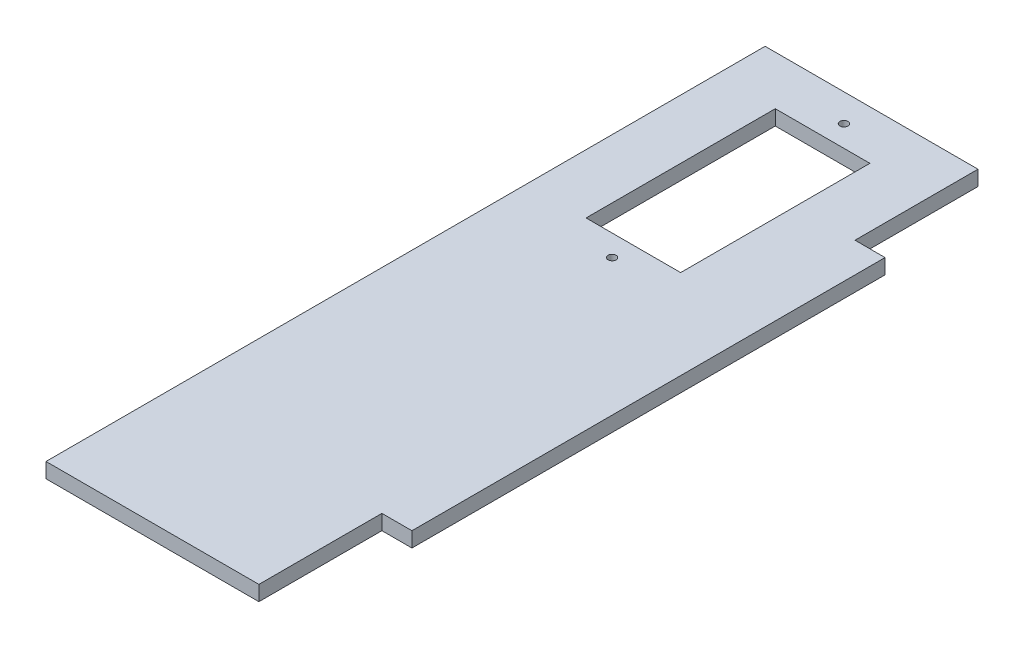
ISO-10303-21;
HEADER;
FILE_DESCRIPTION(('STEP AP214'),'2;1');
FILE_NAME('part.step','',(''),(''),'','','');
FILE_SCHEMA(('AUTOMOTIVE_DESIGN { 1 0 10303 214 1 1 1 1 }'));
ENDSEC;
DATA;
#1=APPLICATION_CONTEXT('core data for automotive mechanical design processes');
#2=APPLICATION_PROTOCOL_DEFINITION('international standard','automotive_design',2000,#1);
#3=PRODUCT_CONTEXT('',#1,'mechanical');
#4=PRODUCT('Part','Part','',(#3));
#5=PRODUCT_RELATED_PRODUCT_CATEGORY('part','',(#4));
#6=PRODUCT_DEFINITION_FORMATION('','',#4);
#7=PRODUCT_DEFINITION_CONTEXT('part definition',#1,'design');
#8=PRODUCT_DEFINITION('design','',#6,#7);
#9=PRODUCT_DEFINITION_SHAPE('','',#8);
#10=(LENGTH_UNIT() NAMED_UNIT(*) SI_UNIT(.MILLI.,.METRE.));
#11=(NAMED_UNIT(*) PLANE_ANGLE_UNIT() SI_UNIT($,.RADIAN.));
#12=(NAMED_UNIT(*) SI_UNIT($,.STERADIAN.) SOLID_ANGLE_UNIT());
#13=UNCERTAINTY_MEASURE_WITH_UNIT(LENGTH_MEASURE(1.E-05),#10,'distance_accuracy_value','');
#14=(GEOMETRIC_REPRESENTATION_CONTEXT(3) GLOBAL_UNCERTAINTY_ASSIGNED_CONTEXT((#13)) GLOBAL_UNIT_ASSIGNED_CONTEXT((#10,
#11,#12)) REPRESENTATION_CONTEXT('',''));
#15=CARTESIAN_POINT('',(0.,0.,0.));
#16=DIRECTION('',(0.,0.,1.));
#17=DIRECTION('',(1.,0.,0.));
#18=AXIS2_PLACEMENT_3D('',#15,#16,#17);
#19=CARTESIAN_POINT('',(-22.5,3.175,0.));
#20=DIRECTION('',(-1.,0.,0.));
#21=DIRECTION('',(0.,0.,1.));
#22=AXIS2_PLACEMENT_3D('',#19,#20,#21);
#23=PLANE('',#22);
#24=DIRECTION('',(0.,0.,-1.));
#25=VECTOR('',#24,1.);
#26=CARTESIAN_POINT('',(-22.5,0.,0.));
#27=LINE('',#26,#25);
#28=CARTESIAN_POINT('',(-22.5,0.,126.));
#29=VERTEX_POINT('',#28);
#30=CARTESIAN_POINT('',(-22.5,0.,-26.));
#31=VERTEX_POINT('',#30);
#32=EDGE_CURVE('E158',#29,#31,#27,.T.);
#33=ORIENTED_EDGE('',*,*,#32,.F.);
#34=DIRECTION('',(0.,-1.,0.));
#35=VECTOR('',#34,1.);
#36=CARTESIAN_POINT('',(-22.5,3.175,126.));
#37=LINE('',#36,#35);
#38=CARTESIAN_POINT('',(-22.5,3.175,126.));
#39=VERTEX_POINT('',#38);
#40=EDGE_CURVE('E11',#39,#29,#37,.T.);
#41=ORIENTED_EDGE('',*,*,#40,.F.);
#42=DIRECTION('',(0.,0.,-1.));
#43=VECTOR('',#42,1.);
#44=CARTESIAN_POINT('',(-22.5,3.175,0.));
#45=LINE('',#44,#43);
#46=CARTESIAN_POINT('',(-22.5,3.175,-26.));
#47=VERTEX_POINT('',#46);
#48=EDGE_CURVE('E162',#39,#47,#45,.T.);
#49=ORIENTED_EDGE('',*,*,#48,.T.);
#50=DIRECTION('',(0.,-1.,0.));
#51=VECTOR('',#50,1.);
#52=CARTESIAN_POINT('',(-22.5,3.175,-26.));
#53=LINE('',#52,#51);
#54=EDGE_CURVE('E187',#47,#31,#53,.T.);
#55=ORIENTED_EDGE('',*,*,#54,.T.);
#56=EDGE_LOOP('',(#33,#41,#49,#55));
#57=FACE_BOUND('',#56,.T.);
#58=ADVANCED_FACE('F35',(#57),#23,.T.);
#59=CARTESIAN_POINT('',(0.,3.175,126.));
#60=DIRECTION('',(0.,0.,1.));
#61=DIRECTION('',(1.,0.,0.));
#62=AXIS2_PLACEMENT_3D('',#59,#60,#61);
#63=PLANE('',#62);
#64=DIRECTION('',(-1.,0.,0.));
#65=VECTOR('',#64,1.);
#66=CARTESIAN_POINT('',(0.,0.,126.));
#67=LINE('',#66,#65);
#68=CARTESIAN_POINT('',(22.5,0.,126.));
#69=VERTEX_POINT('',#68);
#70=EDGE_CURVE('E190',#69,#29,#67,.T.);
#71=ORIENTED_EDGE('',*,*,#70,.F.);
#72=DIRECTION('',(0.,-1.,0.));
#73=VECTOR('',#72,1.);
#74=CARTESIAN_POINT('',(22.5,3.175,126.));
#75=LINE('',#74,#73);
#76=CARTESIAN_POINT('',(22.5,3.175,126.));
#77=VERTEX_POINT('',#76);
#78=EDGE_CURVE('E42',#77,#69,#75,.T.);
#79=ORIENTED_EDGE('',*,*,#78,.F.);
#80=DIRECTION('',(-1.,0.,0.));
#81=VECTOR('',#80,1.);
#82=CARTESIAN_POINT('',(0.,3.175,126.));
#83=LINE('',#82,#81);
#84=EDGE_CURVE('E165',#77,#39,#83,.T.);
#85=ORIENTED_EDGE('',*,*,#84,.T.);
#86=ORIENTED_EDGE('',*,*,#40,.T.);
#87=EDGE_LOOP('',(#71,#79,#85,#86));
#88=FACE_BOUND('',#87,.T.);
#89=ADVANCED_FACE('F227',(#88),#63,.T.);
#90=CARTESIAN_POINT('',(22.5,3.175,0.));
#91=DIRECTION('',(1.,0.,0.));
#92=DIRECTION('',(0.,0.,-1.));
#93=AXIS2_PLACEMENT_3D('',#90,#91,#92);
#94=PLANE('',#93);
#95=DIRECTION('',(0.,0.,1.));
#96=VECTOR('',#95,1.);
#97=CARTESIAN_POINT('',(22.5,0.,0.));
#98=LINE('',#97,#96);
#99=CARTESIAN_POINT('',(22.5,0.,100.));
#100=VERTEX_POINT('',#99);
#101=EDGE_CURVE('E193',#100,#69,#98,.T.);
#102=ORIENTED_EDGE('',*,*,#101,.F.);
#103=DIRECTION('',(0.,-1.,0.));
#104=VECTOR('',#103,1.);
#105=CARTESIAN_POINT('',(22.5,3.175,100.));
#106=LINE('',#105,#104);
#107=CARTESIAN_POINT('',(22.5,3.175,100.));
#108=VERTEX_POINT('',#107);
#109=EDGE_CURVE('E219',#108,#100,#106,.T.);
#110=ORIENTED_EDGE('',*,*,#109,.F.);
#111=DIRECTION('',(0.,0.,1.));
#112=VECTOR('',#111,1.);
#113=CARTESIAN_POINT('',(22.5,3.175,0.));
#114=LINE('',#113,#112);
#115=EDGE_CURVE('E169',#108,#77,#114,.T.);
#116=ORIENTED_EDGE('',*,*,#115,.T.);
#117=ORIENTED_EDGE('',*,*,#78,.T.);
#118=EDGE_LOOP('',(#102,#110,#116,#117));
#119=FACE_BOUND('',#118,.T.);
#120=ADVANCED_FACE('F223',(#119),#94,.T.);
#121=CARTESIAN_POINT('',(0.,3.175,100.));
#122=DIRECTION('',(0.,0.,1.));
#123=DIRECTION('',(1.,0.,0.));
#124=AXIS2_PLACEMENT_3D('',#121,#122,#123);
#125=PLANE('',#124);
#126=DIRECTION('',(-1.,0.,0.));
#127=VECTOR('',#126,1.);
#128=CARTESIAN_POINT('',(0.,0.,100.));
#129=LINE('',#128,#127);
#130=CARTESIAN_POINT('',(28.85,0.,100.));
#131=VERTEX_POINT('',#130);
#132=EDGE_CURVE('E196',#131,#100,#129,.T.);
#133=ORIENTED_EDGE('',*,*,#132,.F.);
#134=DIRECTION('',(0.,-1.,0.));
#135=VECTOR('',#134,1.);
#136=CARTESIAN_POINT('',(28.85,3.175,100.));
#137=LINE('',#136,#135);
#138=CARTESIAN_POINT('',(28.85,3.175,100.));
#139=VERTEX_POINT('',#138);
#140=EDGE_CURVE('E217',#139,#131,#137,.T.);
#141=ORIENTED_EDGE('',*,*,#140,.F.);
#142=DIRECTION('',(-1.,0.,0.));
#143=VECTOR('',#142,1.);
#144=CARTESIAN_POINT('',(0.,3.175,100.));
#145=LINE('',#144,#143);
#146=EDGE_CURVE('E172',#139,#108,#145,.T.);
#147=ORIENTED_EDGE('',*,*,#146,.T.);
#148=ORIENTED_EDGE('',*,*,#109,.T.);
#149=EDGE_LOOP('',(#133,#141,#147,#148));
#150=FACE_BOUND('',#149,.T.);
#151=ADVANCED_FACE('F232',(#150),#125,.T.);
#152=CARTESIAN_POINT('',(28.85,3.175,0.));
#153=DIRECTION('',(1.,0.,0.));
#154=DIRECTION('',(0.,0.,-1.));
#155=AXIS2_PLACEMENT_3D('',#152,#153,#154);
#156=PLANE('',#155);
#157=DIRECTION('',(0.,0.,1.));
#158=VECTOR('',#157,1.);
#159=CARTESIAN_POINT('',(28.85,0.,0.));
#160=LINE('',#159,#158);
#161=CARTESIAN_POINT('',(28.85,0.,0.));
#162=VERTEX_POINT('',#161);
#163=EDGE_CURVE('E199',#162,#131,#160,.T.);
#164=ORIENTED_EDGE('',*,*,#163,.F.);
#165=DIRECTION('',(0.,-1.,0.));
#166=VECTOR('',#165,1.);
#167=CARTESIAN_POINT('',(28.85,3.175,0.));
#168=LINE('',#167,#166);
#169=CARTESIAN_POINT('',(28.85,3.175,0.));
#170=VERTEX_POINT('',#169);
#171=EDGE_CURVE('E215',#170,#162,#168,.T.);
#172=ORIENTED_EDGE('',*,*,#171,.F.);
#173=DIRECTION('',(0.,0.,1.));
#174=VECTOR('',#173,1.);
#175=CARTESIAN_POINT('',(28.85,3.175,0.));
#176=LINE('',#175,#174);
#177=EDGE_CURVE('E175',#170,#139,#176,.T.);
#178=ORIENTED_EDGE('',*,*,#177,.T.);
#179=ORIENTED_EDGE('',*,*,#140,.T.);
#180=EDGE_LOOP('',(#164,#172,#178,#179));
#181=FACE_BOUND('',#180,.T.);
#182=ADVANCED_FACE('F252',(#181),#156,.T.);
#183=CARTESIAN_POINT('',(0.,3.175,0.));
#184=DIRECTION('',(0.,0.,-1.));
#185=DIRECTION('',(-1.,0.,0.));
#186=AXIS2_PLACEMENT_3D('',#183,#184,#185);
#187=PLANE('',#186);
#188=DIRECTION('',(1.,0.,0.));
#189=VECTOR('',#188,1.);
#190=CARTESIAN_POINT('',(0.,0.,0.));
#191=LINE('',#190,#189);
#192=CARTESIAN_POINT('',(22.5,0.,0.));
#193=VERTEX_POINT('',#192);
#194=EDGE_CURVE('E202',#193,#162,#191,.T.);
#195=ORIENTED_EDGE('',*,*,#194,.F.);
#196=DIRECTION('',(0.,-1.,0.));
#197=VECTOR('',#196,1.);
#198=CARTESIAN_POINT('',(22.5,3.175,0.));
#199=LINE('',#198,#197);
#200=CARTESIAN_POINT('',(22.5,3.175,0.));
#201=VERTEX_POINT('',#200);
#202=EDGE_CURVE('E213',#201,#193,#199,.T.);
#203=ORIENTED_EDGE('',*,*,#202,.F.);
#204=DIRECTION('',(1.,0.,0.));
#205=VECTOR('',#204,1.);
#206=CARTESIAN_POINT('',(0.,3.175,0.));
#207=LINE('',#206,#205);
#208=EDGE_CURVE('E178',#201,#170,#207,.T.);
#209=ORIENTED_EDGE('',*,*,#208,.T.);
#210=ORIENTED_EDGE('',*,*,#171,.T.);
#211=EDGE_LOOP('',(#195,#203,#209,#210));
#212=FACE_BOUND('',#211,.T.);
#213=ADVANCED_FACE('F249',(#212),#187,.T.);
#214=CARTESIAN_POINT('',(22.5,3.175,0.));
#215=DIRECTION('',(1.,0.,0.));
#216=DIRECTION('',(0.,0.,-1.));
#217=AXIS2_PLACEMENT_3D('',#214,#215,#216);
#218=PLANE('',#217);
#219=DIRECTION('',(0.,0.,1.));
#220=VECTOR('',#219,1.);
#221=CARTESIAN_POINT('',(22.5,0.,0.));
#222=LINE('',#221,#220);
#223=CARTESIAN_POINT('',(22.5,0.,-26.));
#224=VERTEX_POINT('',#223);
#225=EDGE_CURVE('E205',#224,#193,#222,.T.);
#226=ORIENTED_EDGE('',*,*,#225,.F.);
#227=DIRECTION('',(0.,-1.,0.));
#228=VECTOR('',#227,1.);
#229=CARTESIAN_POINT('',(22.5,3.175,-26.));
#230=LINE('',#229,#228);
#231=CARTESIAN_POINT('',(22.5,3.175,-26.));
#232=VERTEX_POINT('',#231);
#233=EDGE_CURVE('E211',#232,#224,#230,.T.);
#234=ORIENTED_EDGE('',*,*,#233,.F.);
#235=DIRECTION('',(0.,0.,1.));
#236=VECTOR('',#235,1.);
#237=CARTESIAN_POINT('',(22.5,3.175,0.));
#238=LINE('',#237,#236);
#239=EDGE_CURVE('E181',#232,#201,#238,.T.);
#240=ORIENTED_EDGE('',*,*,#239,.T.);
#241=ORIENTED_EDGE('',*,*,#202,.T.);
#242=EDGE_LOOP('',(#226,#234,#240,#241));
#243=FACE_BOUND('',#242,.T.);
#244=ADVANCED_FACE('F246',(#243),#218,.T.);
#245=CARTESIAN_POINT('',(0.,3.175,-26.));
#246=DIRECTION('',(0.,0.,-1.));
#247=DIRECTION('',(-1.,0.,0.));
#248=AXIS2_PLACEMENT_3D('',#245,#246,#247);
#249=PLANE('',#248);
#250=DIRECTION('',(1.,0.,0.));
#251=VECTOR('',#250,1.);
#252=CARTESIAN_POINT('',(0.,0.,-26.));
#253=LINE('',#252,#251);
#254=EDGE_CURVE('E166',#31,#224,#253,.T.);
#255=ORIENTED_EDGE('',*,*,#254,.F.);
#256=ORIENTED_EDGE('',*,*,#54,.F.);
#257=DIRECTION('',(1.,0.,0.));
#258=VECTOR('',#257,1.);
#259=CARTESIAN_POINT('',(0.,3.175,-26.));
#260=LINE('',#259,#258);
#261=EDGE_CURVE('E184',#47,#232,#260,.T.);
#262=ORIENTED_EDGE('',*,*,#261,.T.);
#263=ORIENTED_EDGE('',*,*,#233,.T.);
#264=EDGE_LOOP('',(#255,#256,#262,#263));
#265=FACE_BOUND('',#264,.T.);
#266=ADVANCED_FACE('F243',(#265),#249,.T.);
#267=CARTESIAN_POINT('',(0.,3.175,0.));
#268=DIRECTION('',(0.,1.,0.));
#269=DIRECTION('',(0.,0.,1.));
#270=AXIS2_PLACEMENT_3D('',#267,#268,#269);
#271=PLANE('',#270);
#272=CARTESIAN_POINT('',(0.,3.175,28.85));
#273=DIRECTION('',(0.,1.,0.));
#274=DIRECTION('',(0.,0.,1.));
#275=AXIS2_PLACEMENT_3D('',#272,#273,#274);
#276=CIRCLE('',#275,0.849999999999988);
#277=CARTESIAN_POINT('',(0.,3.175,29.7));
#278=VERTEX_POINT('',#277);
#279=EDGE_CURVE('E384',#278,#278,#276,.T.);
#280=ORIENTED_EDGE('',*,*,#279,.F.);
#281=EDGE_LOOP('',(#280));
#282=FACE_BOUND('',#281,.T.);
#283=CARTESIAN_POINT('',(0.,3.175,-20.15));
#284=DIRECTION('',(0.,1.,0.));
#285=DIRECTION('',(0.,0.,1.));
#286=AXIS2_PLACEMENT_3D('',#283,#284,#285);
#287=CIRCLE('',#286,0.849999999999988);
#288=CARTESIAN_POINT('',(0.,3.175,-19.3));
#289=VERTEX_POINT('',#288);
#290=EDGE_CURVE('E386',#289,#289,#287,.T.);
#291=ORIENTED_EDGE('',*,*,#290,.F.);
#292=EDGE_LOOP('',(#291));
#293=FACE_BOUND('',#292,.T.);
#294=DIRECTION('',(0.,0.,-1.));
#295=VECTOR('',#294,1.);
#296=CARTESIAN_POINT('',(10.,3.175,-15.65));
#297=LINE('',#296,#295);
#298=CARTESIAN_POINT('',(10.,3.175,24.35));
#299=VERTEX_POINT('',#298);
#300=CARTESIAN_POINT('',(10.,3.175,-15.65));
#301=VERTEX_POINT('',#300);
#302=EDGE_CURVE('E49',#299,#301,#297,.T.);
#303=ORIENTED_EDGE('',*,*,#302,.F.);
#304=DIRECTION('',(1.,0.,0.));
#305=VECTOR('',#304,1.);
#306=CARTESIAN_POINT('',(10.,3.175,24.35));
#307=LINE('',#306,#305);
#308=CARTESIAN_POINT('',(-10.,3.175,24.35));
#309=VERTEX_POINT('',#308);
#310=EDGE_CURVE('E140',#309,#299,#307,.T.);
#311=ORIENTED_EDGE('',*,*,#310,.F.);
#312=DIRECTION('',(0.,0.,1.));
#313=VECTOR('',#312,1.);
#314=CARTESIAN_POINT('',(-10.,3.175,-15.65));
#315=LINE('',#314,#313);
#316=CARTESIAN_POINT('',(-10.,3.175,-15.65));
#317=VERTEX_POINT('',#316);
#318=EDGE_CURVE('E143',#317,#309,#315,.T.);
#319=ORIENTED_EDGE('',*,*,#318,.F.);
#320=DIRECTION('',(-1.,0.,0.));
#321=VECTOR('',#320,1.);
#322=CARTESIAN_POINT('',(10.,3.175,-15.65));
#323=LINE('',#322,#321);
#324=EDGE_CURVE('E152',#301,#317,#323,.T.);
#325=ORIENTED_EDGE('',*,*,#324,.F.);
#326=EDGE_LOOP('',(#303,#311,#319,#325));
#327=FACE_BOUND('',#326,.T.);
#328=ORIENTED_EDGE('',*,*,#48,.F.);
#329=ORIENTED_EDGE('',*,*,#84,.F.);
#330=ORIENTED_EDGE('',*,*,#115,.F.);
#331=ORIENTED_EDGE('',*,*,#146,.F.);
#332=ORIENTED_EDGE('',*,*,#177,.F.);
#333=ORIENTED_EDGE('',*,*,#208,.F.);
#334=ORIENTED_EDGE('',*,*,#239,.F.);
#335=ORIENTED_EDGE('',*,*,#261,.F.);
#336=EDGE_LOOP('',(#328,#329,#330,#331,#332,#333,#334,#335));
#337=FACE_BOUND('',#336,.T.);
#338=ADVANCED_FACE('F236',(#282,#293,#327,#337),#271,.T.);
#339=CARTESIAN_POINT('',(0.,0.,0.));
#340=DIRECTION('',(0.,1.,0.));
#341=DIRECTION('',(0.,0.,1.));
#342=AXIS2_PLACEMENT_3D('',#339,#340,#341);
#343=PLANE('',#342);
#344=CARTESIAN_POINT('',(0.,0.,28.85));
#345=DIRECTION('',(0.,1.,0.));
#346=DIRECTION('',(0.,0.,1.));
#347=AXIS2_PLACEMENT_3D('',#344,#345,#346);
#348=CIRCLE('',#347,0.849999999999999);
#349=CARTESIAN_POINT('',(0.,0.,29.7));
#350=VERTEX_POINT('',#349);
#351=EDGE_CURVE('E381',#350,#350,#348,.T.);
#352=ORIENTED_EDGE('',*,*,#351,.T.);
#353=EDGE_LOOP('',(#352));
#354=FACE_BOUND('',#353,.T.);
#355=CARTESIAN_POINT('',(0.,0.,-20.15));
#356=DIRECTION('',(0.,1.,0.));
#357=DIRECTION('',(0.,0.,1.));
#358=AXIS2_PLACEMENT_3D('',#355,#356,#357);
#359=CIRCLE('',#358,0.849999999999999);
#360=CARTESIAN_POINT('',(0.,0.,-19.3));
#361=VERTEX_POINT('',#360);
#362=EDGE_CURVE('E146',#361,#361,#359,.T.);
#363=ORIENTED_EDGE('',*,*,#362,.T.);
#364=EDGE_LOOP('',(#363));
#365=FACE_BOUND('',#364,.T.);
#366=DIRECTION('',(1.,0.,0.));
#367=VECTOR('',#366,1.);
#368=CARTESIAN_POINT('',(10.,0.,24.35));
#369=LINE('',#368,#367);
#370=CARTESIAN_POINT('',(-10.,0.,24.35));
#371=VERTEX_POINT('',#370);
#372=CARTESIAN_POINT('',(10.,0.,24.35));
#373=VERTEX_POINT('',#372);
#374=EDGE_CURVE('E130',#371,#373,#369,.T.);
#375=ORIENTED_EDGE('',*,*,#374,.T.);
#376=DIRECTION('',(0.,0.,-1.));
#377=VECTOR('',#376,1.);
#378=CARTESIAN_POINT('',(10.,0.,-15.65));
#379=LINE('',#378,#377);
#380=CARTESIAN_POINT('',(10.,0.,-15.65));
#381=VERTEX_POINT('',#380);
#382=EDGE_CURVE('E124',#373,#381,#379,.T.);
#383=ORIENTED_EDGE('',*,*,#382,.T.);
#384=DIRECTION('',(-1.,0.,0.));
#385=VECTOR('',#384,1.);
#386=CARTESIAN_POINT('',(10.,0.,-15.65));
#387=LINE('',#386,#385);
#388=CARTESIAN_POINT('',(-10.,0.,-15.65));
#389=VERTEX_POINT('',#388);
#390=EDGE_CURVE('E133',#381,#389,#387,.T.);
#391=ORIENTED_EDGE('',*,*,#390,.T.);
#392=DIRECTION('',(0.,0.,1.));
#393=VECTOR('',#392,1.);
#394=CARTESIAN_POINT('',(-10.,0.,-15.65));
#395=LINE('',#394,#393);
#396=EDGE_CURVE('E57',#389,#371,#395,.T.);
#397=ORIENTED_EDGE('',*,*,#396,.T.);
#398=EDGE_LOOP('',(#375,#383,#391,#397));
#399=FACE_BOUND('',#398,.T.);
#400=ORIENTED_EDGE('',*,*,#32,.T.);
#401=ORIENTED_EDGE('',*,*,#254,.T.);
#402=ORIENTED_EDGE('',*,*,#225,.T.);
#403=ORIENTED_EDGE('',*,*,#194,.T.);
#404=ORIENTED_EDGE('',*,*,#163,.T.);
#405=ORIENTED_EDGE('',*,*,#132,.T.);
#406=ORIENTED_EDGE('',*,*,#101,.T.);
#407=ORIENTED_EDGE('',*,*,#70,.T.);
#408=EDGE_LOOP('',(#400,#401,#402,#403,#404,#405,#406,#407));
#409=FACE_BOUND('',#408,.T.);
#410=ADVANCED_FACE('F137',(#354,#365,#399,#409),#343,.F.);
#411=CARTESIAN_POINT('',(10.,0.,-15.65));
#412=DIRECTION('',(1.,0.,0.));
#413=DIRECTION('',(0.,0.,-1.));
#414=AXIS2_PLACEMENT_3D('',#411,#412,#413);
#415=PLANE('',#414);
#416=ORIENTED_EDGE('',*,*,#302,.T.);
#417=DIRECTION('',(0.,1.,0.));
#418=VECTOR('',#417,1.);
#419=CARTESIAN_POINT('',(10.,0.,-15.65));
#420=LINE('',#419,#418);
#421=EDGE_CURVE('E120',#381,#301,#420,.T.);
#422=ORIENTED_EDGE('',*,*,#421,.F.);
#423=ORIENTED_EDGE('',*,*,#382,.F.);
#424=DIRECTION('',(0.,1.,0.));
#425=VECTOR('',#424,1.);
#426=CARTESIAN_POINT('',(10.,0.,24.35));
#427=LINE('',#426,#425);
#428=EDGE_CURVE('E156',#373,#299,#427,.T.);
#429=ORIENTED_EDGE('',*,*,#428,.T.);
#430=EDGE_LOOP('',(#416,#422,#423,#429));
#431=FACE_BOUND('',#430,.T.);
#432=ADVANCED_FACE('F122',(#431),#415,.F.);
#433=CARTESIAN_POINT('',(10.,0.,24.35));
#434=DIRECTION('',(0.,0.,1.));
#435=DIRECTION('',(1.,0.,0.));
#436=AXIS2_PLACEMENT_3D('',#433,#434,#435);
#437=PLANE('',#436);
#438=ORIENTED_EDGE('',*,*,#310,.T.);
#439=ORIENTED_EDGE('',*,*,#428,.F.);
#440=ORIENTED_EDGE('',*,*,#374,.F.);
#441=DIRECTION('',(0.,1.,0.));
#442=VECTOR('',#441,1.);
#443=CARTESIAN_POINT('',(-10.,0.,24.35));
#444=LINE('',#443,#442);
#445=EDGE_CURVE('E159',#371,#309,#444,.T.);
#446=ORIENTED_EDGE('',*,*,#445,.T.);
#447=EDGE_LOOP('',(#438,#439,#440,#446));
#448=FACE_BOUND('',#447,.T.);
#449=ADVANCED_FACE('F312',(#448),#437,.F.);
#450=CARTESIAN_POINT('',(-10.,0.,-15.65));
#451=DIRECTION('',(-1.,0.,0.));
#452=DIRECTION('',(0.,0.,1.));
#453=AXIS2_PLACEMENT_3D('',#450,#451,#452);
#454=PLANE('',#453);
#455=ORIENTED_EDGE('',*,*,#318,.T.);
#456=ORIENTED_EDGE('',*,*,#445,.F.);
#457=ORIENTED_EDGE('',*,*,#396,.F.);
#458=DIRECTION('',(0.,1.,0.));
#459=VECTOR('',#458,1.);
#460=CARTESIAN_POINT('',(-10.,0.,-15.65));
#461=LINE('',#460,#459);
#462=EDGE_CURVE('E129',#389,#317,#461,.T.);
#463=ORIENTED_EDGE('',*,*,#462,.T.);
#464=EDGE_LOOP('',(#455,#456,#457,#463));
#465=FACE_BOUND('',#464,.T.);
#466=ADVANCED_FACE('F323',(#465),#454,.F.);
#467=CARTESIAN_POINT('',(10.,0.,-15.65));
#468=DIRECTION('',(0.,0.,-1.));
#469=DIRECTION('',(-1.,0.,0.));
#470=AXIS2_PLACEMENT_3D('',#467,#468,#469);
#471=PLANE('',#470);
#472=ORIENTED_EDGE('',*,*,#324,.T.);
#473=ORIENTED_EDGE('',*,*,#462,.F.);
#474=ORIENTED_EDGE('',*,*,#390,.F.);
#475=ORIENTED_EDGE('',*,*,#421,.T.);
#476=EDGE_LOOP('',(#472,#473,#474,#475));
#477=FACE_BOUND('',#476,.T.);
#478=ADVANCED_FACE('F134',(#477),#471,.F.);
#479=CARTESIAN_POINT('',(0.,3.175,-20.15));
#480=DIRECTION('',(0.,1.,0.));
#481=DIRECTION('',(0.,0.,1.));
#482=AXIS2_PLACEMENT_3D('',#479,#480,#481);
#483=CYLINDRICAL_SURFACE('',#482,0.849999999999993);
#484=ORIENTED_EDGE('',*,*,#362,.F.);
#485=EDGE_LOOP('',(#484));
#486=FACE_BOUND('',#485,.T.);
#487=ORIENTED_EDGE('',*,*,#290,.T.);
#488=EDGE_LOOP('',(#487));
#489=FACE_BOUND('',#488,.T.);
#490=ADVANCED_FACE('F341',(#486,#489),#483,.F.);
#491=CARTESIAN_POINT('',(0.,3.175,28.85));
#492=DIRECTION('',(0.,1.,0.));
#493=DIRECTION('',(0.,0.,1.));
#494=AXIS2_PLACEMENT_3D('',#491,#492,#493);
#495=CYLINDRICAL_SURFACE('',#494,0.849999999999993);
#496=ORIENTED_EDGE('',*,*,#351,.F.);
#497=EDGE_LOOP('',(#496));
#498=FACE_BOUND('',#497,.T.);
#499=ORIENTED_EDGE('',*,*,#279,.T.);
#500=EDGE_LOOP('',(#499));
#501=FACE_BOUND('',#500,.T.);
#502=ADVANCED_FACE('F364',(#498,#501),#495,.F.);
#503=CLOSED_SHELL('',(#58,#89,#120,#151,#182,#213,#244,#266,#338,#410,#432,#449,#466,#478,#490,#502));
#504=MANIFOLD_SOLID_BREP('B2',#503);
#505=ADVANCED_BREP_SHAPE_REPRESENTATION('',(#18,#504),#14);
#506=SHAPE_DEFINITION_REPRESENTATION(#9,#505);
ENDSEC;
END-ISO-10303-21;
